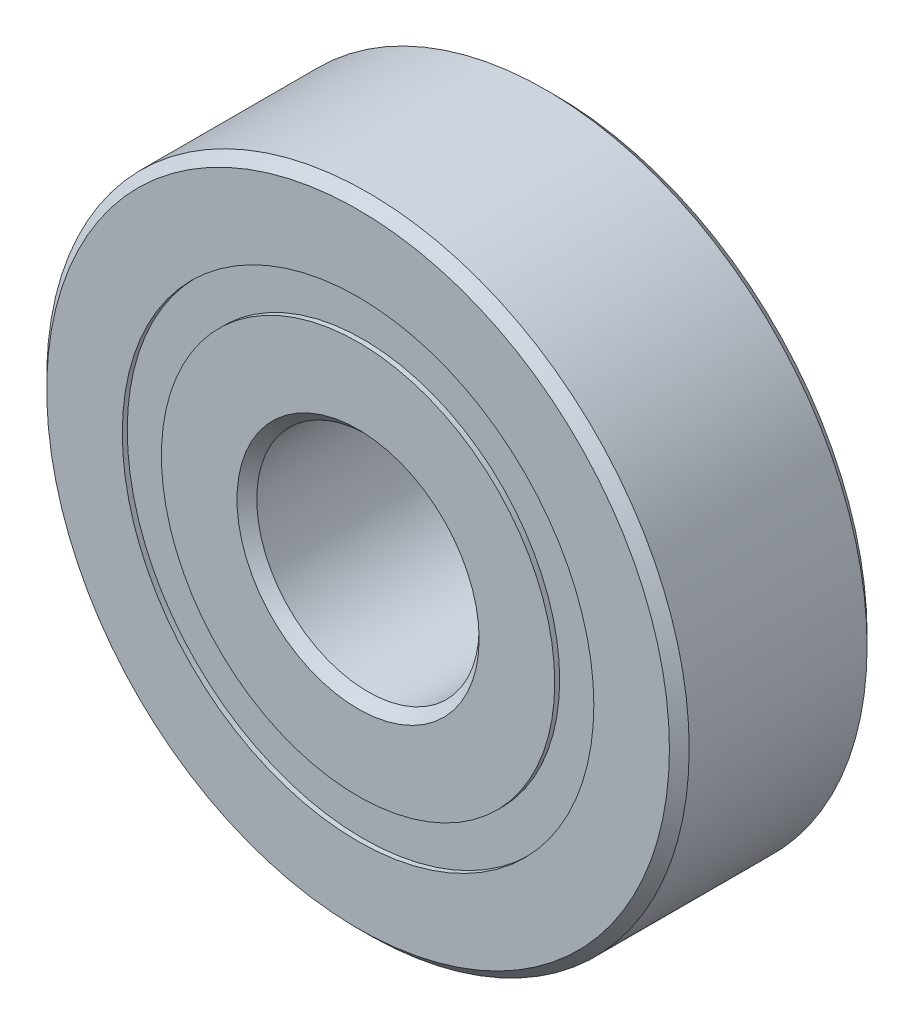
ISO-10303-21;
HEADER;
FILE_DESCRIPTION(('STEP AP214'),'2;1');
FILE_NAME('part.step','',(''),(''),'','','');
FILE_SCHEMA(('AUTOMOTIVE_DESIGN { 1 0 10303 214 1 1 1 1 }'));
ENDSEC;
DATA;
#1=APPLICATION_CONTEXT('core data for automotive mechanical design processes');
#2=APPLICATION_PROTOCOL_DEFINITION('international standard','automotive_design',2000,#1);
#3=PRODUCT_CONTEXT('',#1,'mechanical');
#4=PRODUCT('Part','Part','',(#3));
#5=PRODUCT_RELATED_PRODUCT_CATEGORY('part','',(#4));
#6=PRODUCT_DEFINITION_FORMATION('','',#4);
#7=PRODUCT_DEFINITION_CONTEXT('part definition',#1,'design');
#8=PRODUCT_DEFINITION('design','',#6,#7);
#9=PRODUCT_DEFINITION_SHAPE('','',#8);
#10=(LENGTH_UNIT() NAMED_UNIT(*) SI_UNIT(.MILLI.,.METRE.));
#11=(NAMED_UNIT(*) PLANE_ANGLE_UNIT() SI_UNIT($,.RADIAN.));
#12=(NAMED_UNIT(*) SI_UNIT($,.STERADIAN.) SOLID_ANGLE_UNIT());
#13=UNCERTAINTY_MEASURE_WITH_UNIT(LENGTH_MEASURE(1.E-05),#10,'distance_accuracy_value','');
#14=(GEOMETRIC_REPRESENTATION_CONTEXT(3) GLOBAL_UNCERTAINTY_ASSIGNED_CONTEXT((#13)) GLOBAL_UNIT_ASSIGNED_CONTEXT((#10,
#11,#12)) REPRESENTATION_CONTEXT('',''));
#15=CARTESIAN_POINT('',(0.,0.,0.));
#16=DIRECTION('',(0.,0.,1.));
#17=DIRECTION('',(1.,0.,0.));
#18=AXIS2_PLACEMENT_3D('',#15,#16,#17);
#19=CARTESIAN_POINT('',(0.,9.54120879120879,-3.8));
#20=DIRECTION('',(0.,0.,1.));
#21=DIRECTION('',(1.,0.,0.));
#22=AXIS2_PLACEMENT_3D('',#19,#20,#21);
#23=PLANE('',#22);
#24=CARTESIAN_POINT('',(0.,0.,-3.8));
#25=DIRECTION('',(0.,0.,1.));
#26=DIRECTION('',(1.,0.,0.));
#27=AXIS2_PLACEMENT_3D('',#24,#25,#26);
#28=CIRCLE('',#27,9.54120879120879);
#29=CARTESIAN_POINT('',(9.54120879120879,0.,-3.8));
#30=VERTEX_POINT('',#29);
#31=EDGE_CURVE('E55',#30,#30,#28,.T.);
#32=ORIENTED_EDGE('',*,*,#31,.F.);
#33=EDGE_LOOP('',(#32));
#34=FACE_BOUND('',#33,.T.);
#35=CARTESIAN_POINT('',(0.,0.,-3.8));
#36=DIRECTION('',(0.,0.,1.));
#37=DIRECTION('',(1.,0.,0.));
#38=AXIS2_PLACEMENT_3D('',#35,#36,#37);
#39=CIRCLE('',#38,7.95879120879121);
#40=CARTESIAN_POINT('',(7.95879120879121,0.,-3.8));
#41=VERTEX_POINT('',#40);
#42=EDGE_CURVE('E11',#41,#41,#39,.T.);
#43=ORIENTED_EDGE('',*,*,#42,.T.);
#44=EDGE_LOOP('',(#43));
#45=FACE_BOUND('',#44,.T.);
#46=ADVANCED_FACE('F41',(#34,#45),#23,.F.);
#47=CARTESIAN_POINT('',(0.,0.,4.));
#48=DIRECTION('',(0.,0.,1.));
#49=DIRECTION('',(1.,0.,0.));
#50=AXIS2_PLACEMENT_3D('',#47,#48,#49);
#51=CYLINDRICAL_SURFACE('',#50,7.95879120879121);
#52=ORIENTED_EDGE('',*,*,#42,.F.);
#53=EDGE_LOOP('',(#52));
#54=FACE_BOUND('',#53,.T.);
#55=CARTESIAN_POINT('',(0.,0.,-1.94589444175335));
#56=DIRECTION('',(0.,0.,1.));
#57=DIRECTION('',(1.,0.,0.));
#58=AXIS2_PLACEMENT_3D('',#55,#56,#57);
#59=CIRCLE('',#58,7.95879120879121);
#60=CARTESIAN_POINT('',(7.95879120879121,0.,-1.94589444175335));
#61=VERTEX_POINT('',#60);
#62=EDGE_CURVE('E47',#61,#61,#59,.T.);
#63=ORIENTED_EDGE('',*,*,#62,.T.);
#64=EDGE_LOOP('',(#63));
#65=FACE_BOUND('',#64,.T.);
#66=ADVANCED_FACE('F64',(#54,#65),#51,.F.);
#67=CARTESIAN_POINT('',(0.,9.54120879120879,-1.94589444175335));
#68=DIRECTION('',(0.,0.,-1.));
#69=DIRECTION('',(-1.,0.,0.));
#70=AXIS2_PLACEMENT_3D('',#67,#68,#69);
#71=PLANE('',#70);
#72=ORIENTED_EDGE('',*,*,#62,.F.);
#73=EDGE_LOOP('',(#72));
#74=FACE_BOUND('',#73,.T.);
#75=CARTESIAN_POINT('',(0.,0.,-1.94589444175335));
#76=DIRECTION('',(0.,0.,1.));
#77=DIRECTION('',(1.,0.,0.));
#78=AXIS2_PLACEMENT_3D('',#75,#76,#77);
#79=CIRCLE('',#78,9.54120879120879);
#80=CARTESIAN_POINT('',(9.54120879120879,0.,-1.94589444175335));
#81=VERTEX_POINT('',#80);
#82=EDGE_CURVE('E51',#81,#81,#79,.T.);
#83=ORIENTED_EDGE('',*,*,#82,.T.);
#84=EDGE_LOOP('',(#83));
#85=FACE_BOUND('',#84,.T.);
#86=ADVANCED_FACE('F68',(#74,#85),#71,.F.);
#87=CARTESIAN_POINT('',(0.,0.,4.));
#88=DIRECTION('',(0.,0.,1.));
#89=DIRECTION('',(1.,0.,0.));
#90=AXIS2_PLACEMENT_3D('',#87,#88,#89);
#91=CYLINDRICAL_SURFACE('',#90,9.54120879120879);
#92=ORIENTED_EDGE('',*,*,#82,.F.);
#93=EDGE_LOOP('',(#92));
#94=FACE_BOUND('',#93,.T.);
#95=ORIENTED_EDGE('',*,*,#31,.T.);
#96=EDGE_LOOP('',(#95));
#97=FACE_BOUND('',#96,.T.);
#98=ADVANCED_FACE('F61',(#94,#97),#91,.T.);
#99=CLOSED_SHELL('',(#46,#66,#86,#98));
#100=MANIFOLD_SOLID_BREP('B2',#99);
#101=CARTESIAN_POINT('',(0.,9.54120879120879,3.8));
#102=DIRECTION('',(0.,0.,-1.));
#103=DIRECTION('',(-1.,0.,0.));
#104=AXIS2_PLACEMENT_3D('',#101,#102,#103);
#105=PLANE('',#104);
#106=CARTESIAN_POINT('',(0.,0.,3.8));
#107=DIRECTION('',(0.,0.,1.));
#108=DIRECTION('',(1.,0.,0.));
#109=AXIS2_PLACEMENT_3D('',#106,#107,#108);
#110=CIRCLE('',#109,7.95879120879121);
#111=CARTESIAN_POINT('',(7.95879120879121,0.,3.8));
#112=VERTEX_POINT('',#111);
#113=EDGE_CURVE('E40',#112,#112,#110,.T.);
#114=ORIENTED_EDGE('',*,*,#113,.F.);
#115=EDGE_LOOP('',(#114));
#116=FACE_BOUND('',#115,.T.);
#117=CARTESIAN_POINT('',(0.,0.,3.8));
#118=DIRECTION('',(0.,0.,1.));
#119=DIRECTION('',(1.,0.,0.));
#120=AXIS2_PLACEMENT_3D('',#117,#118,#119);
#121=CIRCLE('',#120,9.54120879120879);
#122=CARTESIAN_POINT('',(9.54120879120879,0.,3.8));
#123=VERTEX_POINT('',#122);
#124=EDGE_CURVE('E122',#123,#123,#121,.T.);
#125=ORIENTED_EDGE('',*,*,#124,.T.);
#126=EDGE_LOOP('',(#125));
#127=FACE_BOUND('',#126,.T.);
#128=ADVANCED_FACE('F108',(#116,#127),#105,.F.);
#129=CARTESIAN_POINT('',(0.,0.,4.));
#130=DIRECTION('',(0.,0.,1.));
#131=DIRECTION('',(1.,0.,0.));
#132=AXIS2_PLACEMENT_3D('',#129,#130,#131);
#133=CYLINDRICAL_SURFACE('',#132,7.95879120879121);
#134=CARTESIAN_POINT('',(0.,0.,1.94589444175335));
#135=DIRECTION('',(0.,0.,1.));
#136=DIRECTION('',(1.,0.,0.));
#137=AXIS2_PLACEMENT_3D('',#134,#135,#136);
#138=CIRCLE('',#137,7.95879120879121);
#139=CARTESIAN_POINT('',(7.95879120879121,0.,1.94589444175335));
#140=VERTEX_POINT('',#139);
#141=EDGE_CURVE('E114',#140,#140,#138,.T.);
#142=ORIENTED_EDGE('',*,*,#141,.F.);
#143=EDGE_LOOP('',(#142));
#144=FACE_BOUND('',#143,.T.);
#145=ORIENTED_EDGE('',*,*,#113,.T.);
#146=EDGE_LOOP('',(#145));
#147=FACE_BOUND('',#146,.T.);
#148=ADVANCED_FACE('F137',(#144,#147),#133,.F.);
#149=CARTESIAN_POINT('',(0.,9.54120879120879,1.94589444175335));
#150=DIRECTION('',(0.,0.,1.));
#151=DIRECTION('',(1.,0.,0.));
#152=AXIS2_PLACEMENT_3D('',#149,#150,#151);
#153=PLANE('',#152);
#154=CARTESIAN_POINT('',(0.,0.,1.94589444175335));
#155=DIRECTION('',(0.,0.,1.));
#156=DIRECTION('',(1.,0.,0.));
#157=AXIS2_PLACEMENT_3D('',#154,#155,#156);
#158=CIRCLE('',#157,9.54120879120879);
#159=CARTESIAN_POINT('',(9.54120879120879,0.,1.94589444175335));
#160=VERTEX_POINT('',#159);
#161=EDGE_CURVE('E118',#160,#160,#158,.T.);
#162=ORIENTED_EDGE('',*,*,#161,.F.);
#163=EDGE_LOOP('',(#162));
#164=FACE_BOUND('',#163,.T.);
#165=ORIENTED_EDGE('',*,*,#141,.T.);
#166=EDGE_LOOP('',(#165));
#167=FACE_BOUND('',#166,.T.);
#168=ADVANCED_FACE('F132',(#164,#167),#153,.F.);
#169=CARTESIAN_POINT('',(0.,0.,4.));
#170=DIRECTION('',(0.,0.,1.));
#171=DIRECTION('',(1.,0.,0.));
#172=AXIS2_PLACEMENT_3D('',#169,#170,#171);
#173=CYLINDRICAL_SURFACE('',#172,9.54120879120879);
#174=ORIENTED_EDGE('',*,*,#124,.F.);
#175=EDGE_LOOP('',(#174));
#176=FACE_BOUND('',#175,.T.);
#177=ORIENTED_EDGE('',*,*,#161,.T.);
#178=EDGE_LOOP('',(#177));
#179=FACE_BOUND('',#178,.T.);
#180=ADVANCED_FACE('F129',(#176,#179),#173,.T.);
#181=CLOSED_SHELL('',(#128,#148,#168,#180));
#182=MANIFOLD_SOLID_BREP('B6',#181);
#183=CARTESIAN_POINT('',(-4.3749999999999,7.57772228311389,0.));
#184=DIRECTION('',(0.,0.,1.));
#185=DIRECTION('',(-0.499999999999989,0.866025403784445,0.));
#186=AXIS2_PLACEMENT_3D('',#183,#184,#185);
#187=SPHERICAL_SURFACE('',#186,1.94589444175335);
#188=CARTESIAN_POINT('',(-4.3749999999999,7.57772228311389,1.94589444175335));
#189=VERTEX_POINT('',#188);
#190=VERTEX_LOOP('',#189);
#191=FACE_BOUND('',#190,.T.);
#192=ADVANCED_FACE('F175',(#191),#187,.T.);
#193=CLOSED_SHELL('',(#192));
#194=MANIFOLD_SOLID_BREP('B35',#193);
#195=CARTESIAN_POINT('',(-7.57772228311379,4.37500000000009,0.));
#196=DIRECTION('',(0.,0.,1.));
#197=DIRECTION('',(-0.866025403784433,0.50000000000001,0.));
#198=AXIS2_PLACEMENT_3D('',#195,#196,#197);
#199=SPHERICAL_SURFACE('',#198,1.94589444175335);
#200=CARTESIAN_POINT('',(-7.57772228311379,4.37500000000009,1.94589444175335));
#201=VERTEX_POINT('',#200);
#202=VERTEX_LOOP('',#201);
#203=FACE_BOUND('',#202,.T.);
#204=ADVANCED_FACE('F195',(#203),#199,.T.);
#205=CLOSED_SHELL('',(#204));
#206=MANIFOLD_SOLID_BREP('B104',#205);
#207=CARTESIAN_POINT('',(-8.75,0.,0.));
#208=DIRECTION('',(0.,0.,1.));
#209=DIRECTION('',(-1.,0.,0.));
#210=AXIS2_PLACEMENT_3D('',#207,#208,#209);
#211=SPHERICAL_SURFACE('',#210,1.94589444175335);
#212=CARTESIAN_POINT('',(-8.75,0.,1.94589444175335));
#213=VERTEX_POINT('',#212);
#214=VERTEX_LOOP('',#213);
#215=FACE_BOUND('',#214,.T.);
#216=ADVANCED_FACE('F215',(#215),#211,.T.);
#217=CLOSED_SHELL('',(#216));
#218=MANIFOLD_SOLID_BREP('B171',#217);
#219=CARTESIAN_POINT('',(-7.57772228311388,-4.37499999999993,0.));
#220=DIRECTION('',(0.,0.,1.));
#221=DIRECTION('',(-0.866025403784443,-0.499999999999992,0.));
#222=AXIS2_PLACEMENT_3D('',#219,#220,#221);
#223=SPHERICAL_SURFACE('',#222,1.94589444175335);
#224=CARTESIAN_POINT('',(-7.57772228311388,-4.37499999999993,1.94589444175335));
#225=VERTEX_POINT('',#224);
#226=VERTEX_LOOP('',#225);
#227=FACE_BOUND('',#226,.T.);
#228=ADVANCED_FACE('F235',(#227),#223,.T.);
#229=CLOSED_SHELL('',(#228));
#230=MANIFOLD_SOLID_BREP('B191',#229);
#231=CARTESIAN_POINT('',(-4.37500000000006,-7.5777222831138,0.));
#232=DIRECTION('',(0.,0.,1.));
#233=DIRECTION('',(-0.500000000000007,-0.866025403784435,0.));
#234=AXIS2_PLACEMENT_3D('',#231,#232,#233);
#235=SPHERICAL_SURFACE('',#234,1.94589444175335);
#236=CARTESIAN_POINT('',(-4.37500000000006,-7.5777222831138,1.94589444175335));
#237=VERTEX_POINT('',#236);
#238=VERTEX_LOOP('',#237);
#239=FACE_BOUND('',#238,.T.);
#240=ADVANCED_FACE('F255',(#239),#235,.T.);
#241=CLOSED_SHELL('',(#240));
#242=MANIFOLD_SOLID_BREP('B211',#241);
#243=CARTESIAN_POINT('',(0.,-8.75,0.));
#244=DIRECTION('',(0.,0.,1.));
#245=DIRECTION('',(0.,-1.,0.));
#246=AXIS2_PLACEMENT_3D('',#243,#244,#245);
#247=SPHERICAL_SURFACE('',#246,1.94589444175335);
#248=CARTESIAN_POINT('',(0.,-8.75,1.94589444175335));
#249=VERTEX_POINT('',#248);
#250=VERTEX_LOOP('',#249);
#251=FACE_BOUND('',#250,.T.);
#252=ADVANCED_FACE('F275',(#251),#247,.T.);
#253=CLOSED_SHELL('',(#252));
#254=MANIFOLD_SOLID_BREP('B231',#253);
#255=CARTESIAN_POINT('',(4.37499999999996,-7.57772228311386,0.));
#256=DIRECTION('',(0.,0.,1.));
#257=DIRECTION('',(0.499999999999995,-0.866025403784442,0.));
#258=AXIS2_PLACEMENT_3D('',#255,#256,#257);
#259=SPHERICAL_SURFACE('',#258,1.94589444175335);
#260=CARTESIAN_POINT('',(4.37499999999996,-7.57772228311386,1.94589444175335));
#261=VERTEX_POINT('',#260);
#262=VERTEX_LOOP('',#261);
#263=FACE_BOUND('',#262,.T.);
#264=ADVANCED_FACE('F295',(#263),#259,.T.);
#265=CLOSED_SHELL('',(#264));
#266=MANIFOLD_SOLID_BREP('B251',#265);
#267=CARTESIAN_POINT('',(7.57772228311382,-4.37500000000004,0.));
#268=DIRECTION('',(0.,0.,1.));
#269=DIRECTION('',(0.866025403784436,-0.500000000000004,0.));
#270=AXIS2_PLACEMENT_3D('',#267,#268,#269);
#271=SPHERICAL_SURFACE('',#270,1.94589444175335);
#272=CARTESIAN_POINT('',(7.57772228311382,-4.37500000000004,1.94589444175335));
#273=VERTEX_POINT('',#272);
#274=VERTEX_LOOP('',#273);
#275=FACE_BOUND('',#274,.T.);
#276=ADVANCED_FACE('F315',(#275),#271,.T.);
#277=CLOSED_SHELL('',(#276));
#278=MANIFOLD_SOLID_BREP('B271',#277);
#279=CARTESIAN_POINT('',(8.75,0.,0.));
#280=DIRECTION('',(0.,0.,1.));
#281=DIRECTION('',(1.,0.,0.));
#282=AXIS2_PLACEMENT_3D('',#279,#280,#281);
#283=SPHERICAL_SURFACE('',#282,1.94589444175335);
#284=CARTESIAN_POINT('',(8.75,0.,1.94589444175335));
#285=VERTEX_POINT('',#284);
#286=VERTEX_LOOP('',#285);
#287=FACE_BOUND('',#286,.T.);
#288=ADVANCED_FACE('F335',(#287),#283,.T.);
#289=CLOSED_SHELL('',(#288));
#290=MANIFOLD_SOLID_BREP('B291',#289);
#291=CARTESIAN_POINT('',(7.57772228311385,4.37499999999998,0.));
#292=DIRECTION('',(0.,0.,1.));
#293=DIRECTION('',(0.86602540378444,0.499999999999998,0.));
#294=AXIS2_PLACEMENT_3D('',#291,#292,#293);
#295=SPHERICAL_SURFACE('',#294,1.94589444175335);
#296=CARTESIAN_POINT('',(7.57772228311385,4.37499999999998,1.94589444175335));
#297=VERTEX_POINT('',#296);
#298=VERTEX_LOOP('',#297);
#299=FACE_BOUND('',#298,.T.);
#300=ADVANCED_FACE('F355',(#299),#295,.T.);
#301=CLOSED_SHELL('',(#300));
#302=MANIFOLD_SOLID_BREP('B311',#301);
#303=CARTESIAN_POINT('',(4.37500000000001,7.57772228311383,0.));
#304=DIRECTION('',(0.,0.,1.));
#305=DIRECTION('',(0.500000000000001,0.866025403784438,0.));
#306=AXIS2_PLACEMENT_3D('',#303,#304,#305);
#307=SPHERICAL_SURFACE('',#306,1.94589444175335);
#308=CARTESIAN_POINT('',(4.37500000000001,7.57772228311383,1.94589444175335));
#309=VERTEX_POINT('',#308);
#310=VERTEX_LOOP('',#309);
#311=FACE_BOUND('',#310,.T.);
#312=ADVANCED_FACE('F375',(#311),#307,.T.);
#313=CLOSED_SHELL('',(#312));
#314=MANIFOLD_SOLID_BREP('B331',#313);
#315=CARTESIAN_POINT('',(0.,8.75,0.));
#316=DIRECTION('',(0.,0.,1.));
#317=DIRECTION('',(0.,1.,0.));
#318=AXIS2_PLACEMENT_3D('',#315,#316,#317);
#319=SPHERICAL_SURFACE('',#318,1.94589444175335);
#320=CARTESIAN_POINT('',(0.,8.75,1.94589444175335));
#321=VERTEX_POINT('',#320);
#322=VERTEX_LOOP('',#321);
#323=FACE_BOUND('',#322,.T.);
#324=ADVANCED_FACE('F397',(#323),#319,.T.);
#325=CLOSED_SHELL('',(#324));
#326=MANIFOLD_SOLID_BREP('B351',#325);
#327=CARTESIAN_POINT('',(0.,7.95879120879121,4.));
#328=DIRECTION('',(0.,0.,-1.));
#329=DIRECTION('',(-1.,0.,0.));
#330=AXIS2_PLACEMENT_3D('',#327,#328,#329);
#331=PLANE('',#330);
#332=CARTESIAN_POINT('',(0.,0.,4.));
#333=DIRECTION('',(0.,0.,1.));
#334=DIRECTION('',(1.,0.,0.));
#335=AXIS2_PLACEMENT_3D('',#332,#333,#334);
#336=CIRCLE('',#335,4.9);
#337=CARTESIAN_POINT('',(4.9,0.,4.));
#338=VERTEX_POINT('',#337);
#339=EDGE_CURVE('E444',#338,#338,#336,.T.);
#340=ORIENTED_EDGE('',*,*,#339,.F.);
#341=EDGE_LOOP('',(#340));
#342=FACE_BOUND('',#341,.T.);
#343=CARTESIAN_POINT('',(0.,0.,4.));
#344=DIRECTION('',(0.,0.,1.));
#345=DIRECTION('',(1.,0.,0.));
#346=AXIS2_PLACEMENT_3D('',#343,#344,#345);
#347=CIRCLE('',#346,7.95879120879121);
#348=CARTESIAN_POINT('',(7.95879120879121,0.,4.));
#349=VERTEX_POINT('',#348);
#350=EDGE_CURVE('E396',#349,#349,#347,.T.);
#351=ORIENTED_EDGE('',*,*,#350,.T.);
#352=EDGE_LOOP('',(#351));
#353=FACE_BOUND('',#352,.T.);
#354=ADVANCED_FACE('F416',(#342,#353),#331,.F.);
#355=CARTESIAN_POINT('',(0.,0.,4.));
#356=DIRECTION('',(0.,0.,1.));
#357=DIRECTION('',(1.,0.,0.));
#358=AXIS2_PLACEMENT_3D('',#355,#356,#357);
#359=CYLINDRICAL_SURFACE('',#358,7.95879120879121);
#360=ORIENTED_EDGE('',*,*,#350,.F.);
#361=EDGE_LOOP('',(#360));
#362=FACE_BOUND('',#361,.T.);
#363=CARTESIAN_POINT('',(0.,0.,1.77777777777778));
#364=DIRECTION('',(0.,0.,1.));
#365=DIRECTION('',(1.,0.,0.));
#366=AXIS2_PLACEMENT_3D('',#363,#364,#365);
#367=CIRCLE('',#366,7.95879120879121);
#368=CARTESIAN_POINT('',(7.95879120879121,0.,1.77777777777778));
#369=VERTEX_POINT('',#368);
#370=EDGE_CURVE('E422',#369,#369,#367,.T.);
#371=ORIENTED_EDGE('',*,*,#370,.T.);
#372=EDGE_LOOP('',(#371));
#373=FACE_BOUND('',#372,.T.);
#374=ADVANCED_FACE('F451',(#362,#373),#359,.T.);
#375=CARTESIAN_POINT('',(0.,0.,0.));
#376=DIRECTION('',(0.,0.,1.));
#377=DIRECTION('',(1.,0.,0.));
#378=AXIS2_PLACEMENT_3D('',#375,#376,#377);
#379=TOROIDAL_SURFACE('',#378,8.75,1.94589444175334);
#380=ORIENTED_EDGE('',*,*,#370,.F.);
#381=EDGE_LOOP('',(#380));
#382=FACE_BOUND('',#381,.T.);
#383=CARTESIAN_POINT('',(0.,0.,-1.77777777777778));
#384=DIRECTION('',(0.,0.,1.));
#385=DIRECTION('',(1.,0.,0.));
#386=AXIS2_PLACEMENT_3D('',#383,#384,#385);
#387=CIRCLE('',#386,7.95879120879121);
#388=CARTESIAN_POINT('',(7.95879120879121,0.,-1.77777777777778));
#389=VERTEX_POINT('',#388);
#390=EDGE_CURVE('E426',#389,#389,#387,.T.);
#391=ORIENTED_EDGE('',*,*,#390,.T.);
#392=EDGE_LOOP('',(#391));
#393=FACE_BOUND('',#392,.T.);
#394=ADVANCED_FACE('F455',(#382,#393),#379,.F.);
#395=CARTESIAN_POINT('',(0.,0.,4.));
#396=DIRECTION('',(0.,0.,1.));
#397=DIRECTION('',(1.,0.,0.));
#398=AXIS2_PLACEMENT_3D('',#395,#396,#397);
#399=CYLINDRICAL_SURFACE('',#398,7.95879120879121);
#400=ORIENTED_EDGE('',*,*,#390,.F.);
#401=EDGE_LOOP('',(#400));
#402=FACE_BOUND('',#401,.T.);
#403=CARTESIAN_POINT('',(0.,0.,-4.));
#404=DIRECTION('',(0.,0.,1.));
#405=DIRECTION('',(1.,0.,0.));
#406=AXIS2_PLACEMENT_3D('',#403,#404,#405);
#407=CIRCLE('',#406,7.95879120879121);
#408=CARTESIAN_POINT('',(7.95879120879121,0.,-4.));
#409=VERTEX_POINT('',#408);
#410=EDGE_CURVE('E430',#409,#409,#407,.T.);
#411=ORIENTED_EDGE('',*,*,#410,.T.);
#412=EDGE_LOOP('',(#411));
#413=FACE_BOUND('',#412,.T.);
#414=ADVANCED_FACE('F460',(#402,#413),#399,.T.);
#415=CARTESIAN_POINT('',(0.,4.9,-4.));
#416=DIRECTION('',(0.,0.,1.));
#417=DIRECTION('',(1.,0.,0.));
#418=AXIS2_PLACEMENT_3D('',#415,#416,#417);
#419=PLANE('',#418);
#420=ORIENTED_EDGE('',*,*,#410,.F.);
#421=EDGE_LOOP('',(#420));
#422=FACE_BOUND('',#421,.T.);
#423=CARTESIAN_POINT('',(0.,0.,-4.));
#424=DIRECTION('',(0.,0.,1.));
#425=DIRECTION('',(1.,0.,0.));
#426=AXIS2_PLACEMENT_3D('',#423,#424,#425);
#427=CIRCLE('',#426,4.9);
#428=CARTESIAN_POINT('',(4.9,0.,-4.));
#429=VERTEX_POINT('',#428);
#430=EDGE_CURVE('E435',#429,#429,#427,.T.);
#431=ORIENTED_EDGE('',*,*,#430,.T.);
#432=EDGE_LOOP('',(#431));
#433=FACE_BOUND('',#432,.T.);
#434=ADVANCED_FACE('F466',(#422,#433),#419,.F.);
#435=CARTESIAN_POINT('',(0.,0.,-3.6));
#436=DIRECTION('',(0.,0.,-1.));
#437=DIRECTION('',(-1.,0.,0.));
#438=AXIS2_PLACEMENT_3D('',#435,#436,#437);
#439=CONICAL_SURFACE('',#438,4.5,0.785398163397444);
#440=ORIENTED_EDGE('',*,*,#430,.F.);
#441=EDGE_LOOP('',(#440));
#442=FACE_BOUND('',#441,.T.);
#443=CARTESIAN_POINT('',(0.,0.,-3.6));
#444=DIRECTION('',(0.,0.,1.));
#445=DIRECTION('',(1.,0.,0.));
#446=AXIS2_PLACEMENT_3D('',#443,#444,#445);
#447=CIRCLE('',#446,4.5);
#448=CARTESIAN_POINT('',(4.5,0.,-3.6));
#449=VERTEX_POINT('',#448);
#450=EDGE_CURVE('E438',#449,#449,#447,.T.);
#451=ORIENTED_EDGE('',*,*,#450,.T.);
#452=EDGE_LOOP('',(#451));
#453=FACE_BOUND('',#452,.T.);
#454=ADVANCED_FACE('F470',(#442,#453),#439,.F.);
#455=CARTESIAN_POINT('',(0.,0.,4.));
#456=DIRECTION('',(0.,0.,1.));
#457=DIRECTION('',(1.,0.,0.));
#458=AXIS2_PLACEMENT_3D('',#455,#456,#457);
#459=CYLINDRICAL_SURFACE('',#458,4.5);
#460=ORIENTED_EDGE('',*,*,#450,.F.);
#461=EDGE_LOOP('',(#460));
#462=FACE_BOUND('',#461,.T.);
#463=CARTESIAN_POINT('',(0.,0.,3.6));
#464=DIRECTION('',(0.,0.,1.));
#465=DIRECTION('',(1.,0.,0.));
#466=AXIS2_PLACEMENT_3D('',#463,#464,#465);
#467=CIRCLE('',#466,4.5);
#468=CARTESIAN_POINT('',(4.5,0.,3.6));
#469=VERTEX_POINT('',#468);
#470=EDGE_CURVE('E441',#469,#469,#467,.T.);
#471=ORIENTED_EDGE('',*,*,#470,.T.);
#472=EDGE_LOOP('',(#471));
#473=FACE_BOUND('',#472,.T.);
#474=ADVANCED_FACE('F474',(#462,#473),#459,.F.);
#475=CARTESIAN_POINT('',(0.,0.,4.));
#476=DIRECTION('',(0.,0.,1.));
#477=DIRECTION('',(1.,0.,0.));
#478=AXIS2_PLACEMENT_3D('',#475,#476,#477);
#479=CONICAL_SURFACE('',#478,4.9,0.785398163397453);
#480=ORIENTED_EDGE('',*,*,#470,.F.);
#481=EDGE_LOOP('',(#480));
#482=FACE_BOUND('',#481,.T.);
#483=ORIENTED_EDGE('',*,*,#339,.T.);
#484=EDGE_LOOP('',(#483));
#485=FACE_BOUND('',#484,.T.);
#486=ADVANCED_FACE('F448',(#482,#485),#479,.F.);
#487=CLOSED_SHELL('',(#354,#374,#394,#414,#434,#454,#474,#486));
#488=MANIFOLD_SOLID_BREP('B371',#487);
#489=CARTESIAN_POINT('',(0.,0.,3.6));
#490=DIRECTION('',(0.,0.,-1.));
#491=DIRECTION('',(-1.,0.,0.));
#492=AXIS2_PLACEMENT_3D('',#489,#490,#491);
#493=CONICAL_SURFACE('',#492,13.,0.785398163397447);
#494=CARTESIAN_POINT('',(0.,0.,4.));
#495=DIRECTION('',(0.,0.,1.));
#496=DIRECTION('',(1.,0.,0.));
#497=AXIS2_PLACEMENT_3D('',#494,#495,#496);
#498=CIRCLE('',#497,12.6);
#499=CARTESIAN_POINT('',(12.6,0.,4.));
#500=VERTEX_POINT('',#499);
#501=EDGE_CURVE('E565',#500,#500,#498,.T.);
#502=ORIENTED_EDGE('',*,*,#501,.F.);
#503=EDGE_LOOP('',(#502));
#504=FACE_BOUND('',#503,.T.);
#505=CARTESIAN_POINT('',(0.,0.,3.6));
#506=DIRECTION('',(0.,0.,1.));
#507=DIRECTION('',(1.,0.,0.));
#508=AXIS2_PLACEMENT_3D('',#505,#506,#507);
#509=CIRCLE('',#508,13.);
#510=CARTESIAN_POINT('',(13.,0.,3.6));
#511=VERTEX_POINT('',#510);
#512=EDGE_CURVE('E415',#511,#511,#509,.T.);
#513=ORIENTED_EDGE('',*,*,#512,.T.);
#514=EDGE_LOOP('',(#513));
#515=FACE_BOUND('',#514,.T.);
#516=ADVANCED_FACE('F537',(#504,#515),#493,.T.);
#517=CARTESIAN_POINT('',(0.,0.,4.));
#518=DIRECTION('',(0.,0.,1.));
#519=DIRECTION('',(1.,0.,0.));
#520=AXIS2_PLACEMENT_3D('',#517,#518,#519);
#521=CYLINDRICAL_SURFACE('',#520,13.);
#522=ORIENTED_EDGE('',*,*,#512,.F.);
#523=EDGE_LOOP('',(#522));
#524=FACE_BOUND('',#523,.T.);
#525=CARTESIAN_POINT('',(0.,0.,-3.6));
#526=DIRECTION('',(0.,0.,1.));
#527=DIRECTION('',(1.,0.,0.));
#528=AXIS2_PLACEMENT_3D('',#525,#526,#527);
#529=CIRCLE('',#528,13.);
#530=CARTESIAN_POINT('',(13.,0.,-3.6));
#531=VERTEX_POINT('',#530);
#532=EDGE_CURVE('E543',#531,#531,#529,.T.);
#533=ORIENTED_EDGE('',*,*,#532,.T.);
#534=EDGE_LOOP('',(#533));
#535=FACE_BOUND('',#534,.T.);
#536=ADVANCED_FACE('F572',(#524,#535),#521,.T.);
#537=CARTESIAN_POINT('',(0.,0.,-4.));
#538=DIRECTION('',(0.,0.,1.));
#539=DIRECTION('',(1.,0.,0.));
#540=AXIS2_PLACEMENT_3D('',#537,#538,#539);
#541=CONICAL_SURFACE('',#540,12.6,0.785398163397447);
#542=ORIENTED_EDGE('',*,*,#532,.F.);
#543=EDGE_LOOP('',(#542));
#544=FACE_BOUND('',#543,.T.);
#545=CARTESIAN_POINT('',(0.,0.,-4.));
#546=DIRECTION('',(0.,0.,1.));
#547=DIRECTION('',(1.,0.,0.));
#548=AXIS2_PLACEMENT_3D('',#545,#546,#547);
#549=CIRCLE('',#548,12.6);
#550=CARTESIAN_POINT('',(12.6,0.,-4.));
#551=VERTEX_POINT('',#550);
#552=EDGE_CURVE('E547',#551,#551,#549,.T.);
#553=ORIENTED_EDGE('',*,*,#552,.T.);
#554=EDGE_LOOP('',(#553));
#555=FACE_BOUND('',#554,.T.);
#556=ADVANCED_FACE('F576',(#544,#555),#541,.T.);
#557=CARTESIAN_POINT('',(0.,12.6,-4.));
#558=DIRECTION('',(0.,0.,1.));
#559=DIRECTION('',(1.,0.,0.));
#560=AXIS2_PLACEMENT_3D('',#557,#558,#559);
#561=PLANE('',#560);
#562=ORIENTED_EDGE('',*,*,#552,.F.);
#563=EDGE_LOOP('',(#562));
#564=FACE_BOUND('',#563,.T.);
#565=CARTESIAN_POINT('',(0.,0.,-4.));
#566=DIRECTION('',(0.,0.,1.));
#567=DIRECTION('',(1.,0.,0.));
#568=AXIS2_PLACEMENT_3D('',#565,#566,#567);
#569=CIRCLE('',#568,9.54120879120879);
#570=CARTESIAN_POINT('',(9.54120879120879,0.,-4.));
#571=VERTEX_POINT('',#570);
#572=EDGE_CURVE('E551',#571,#571,#569,.T.);
#573=ORIENTED_EDGE('',*,*,#572,.T.);
#574=EDGE_LOOP('',(#573));
#575=FACE_BOUND('',#574,.T.);
#576=ADVANCED_FACE('F581',(#564,#575),#561,.F.);
#577=CARTESIAN_POINT('',(0.,0.,4.));
#578=DIRECTION('',(0.,0.,1.));
#579=DIRECTION('',(1.,0.,0.));
#580=AXIS2_PLACEMENT_3D('',#577,#578,#579);
#581=CYLINDRICAL_SURFACE('',#580,9.54120879120879);
#582=ORIENTED_EDGE('',*,*,#572,.F.);
#583=EDGE_LOOP('',(#582));
#584=FACE_BOUND('',#583,.T.);
#585=CARTESIAN_POINT('',(0.,0.,-1.77777777777778));
#586=DIRECTION('',(0.,0.,1.));
#587=DIRECTION('',(1.,0.,0.));
#588=AXIS2_PLACEMENT_3D('',#585,#586,#587);
#589=CIRCLE('',#588,9.54120879120879);
#590=CARTESIAN_POINT('',(9.54120879120879,0.,-1.77777777777778));
#591=VERTEX_POINT('',#590);
#592=EDGE_CURVE('E556',#591,#591,#589,.T.);
#593=ORIENTED_EDGE('',*,*,#592,.T.);
#594=EDGE_LOOP('',(#593));
#595=FACE_BOUND('',#594,.T.);
#596=ADVANCED_FACE('F587',(#584,#595),#581,.F.);
#597=CARTESIAN_POINT('',(0.,0.,0.));
#598=DIRECTION('',(0.,0.,1.));
#599=DIRECTION('',(1.,0.,0.));
#600=AXIS2_PLACEMENT_3D('',#597,#598,#599);
#601=TOROIDAL_SURFACE('',#600,8.75,1.94589444175335);
#602=ORIENTED_EDGE('',*,*,#592,.F.);
#603=EDGE_LOOP('',(#602));
#604=FACE_BOUND('',#603,.T.);
#605=CARTESIAN_POINT('',(0.,0.,1.77777777777778));
#606=DIRECTION('',(0.,0.,1.));
#607=DIRECTION('',(1.,0.,0.));
#608=AXIS2_PLACEMENT_3D('',#605,#606,#607);
#609=CIRCLE('',#608,9.54120879120879);
#610=CARTESIAN_POINT('',(9.54120879120879,0.,1.77777777777778));
#611=VERTEX_POINT('',#610);
#612=EDGE_CURVE('E559',#611,#611,#609,.T.);
#613=ORIENTED_EDGE('',*,*,#612,.T.);
#614=EDGE_LOOP('',(#613));
#615=FACE_BOUND('',#614,.T.);
#616=ADVANCED_FACE('F591',(#604,#615),#601,.F.);
#617=CARTESIAN_POINT('',(0.,0.,4.));
#618=DIRECTION('',(0.,0.,1.));
#619=DIRECTION('',(1.,0.,0.));
#620=AXIS2_PLACEMENT_3D('',#617,#618,#619);
#621=CYLINDRICAL_SURFACE('',#620,9.54120879120879);
#622=ORIENTED_EDGE('',*,*,#612,.F.);
#623=EDGE_LOOP('',(#622));
#624=FACE_BOUND('',#623,.T.);
#625=CARTESIAN_POINT('',(0.,0.,4.));
#626=DIRECTION('',(0.,0.,1.));
#627=DIRECTION('',(1.,0.,0.));
#628=AXIS2_PLACEMENT_3D('',#625,#626,#627);
#629=CIRCLE('',#628,9.54120879120879);
#630=CARTESIAN_POINT('',(9.54120879120879,0.,4.));
#631=VERTEX_POINT('',#630);
#632=EDGE_CURVE('E562',#631,#631,#629,.T.);
#633=ORIENTED_EDGE('',*,*,#632,.T.);
#634=EDGE_LOOP('',(#633));
#635=FACE_BOUND('',#634,.T.);
#636=ADVANCED_FACE('F595',(#624,#635),#621,.F.);
#637=CARTESIAN_POINT('',(0.,12.6,4.));
#638=DIRECTION('',(0.,0.,-1.));
#639=DIRECTION('',(-1.,0.,0.));
#640=AXIS2_PLACEMENT_3D('',#637,#638,#639);
#641=PLANE('',#640);
#642=ORIENTED_EDGE('',*,*,#632,.F.);
#643=EDGE_LOOP('',(#642));
#644=FACE_BOUND('',#643,.T.);
#645=ORIENTED_EDGE('',*,*,#501,.T.);
#646=EDGE_LOOP('',(#645));
#647=FACE_BOUND('',#646,.T.);
#648=ADVANCED_FACE('F569',(#644,#647),#641,.F.);
#649=CLOSED_SHELL('',(#516,#536,#556,#576,#596,#616,#636,#648));
#650=MANIFOLD_SOLID_BREP('B391',#649);
#651=ADVANCED_BREP_SHAPE_REPRESENTATION('',(#18,#100,#182,#194,#206,#218,#230,#242,#254,#266,
#278,#290,#302,#314,#326,#488,#650),#14);
#652=SHAPE_DEFINITION_REPRESENTATION(#9,#651);
ENDSEC;
END-ISO-10303-21;
